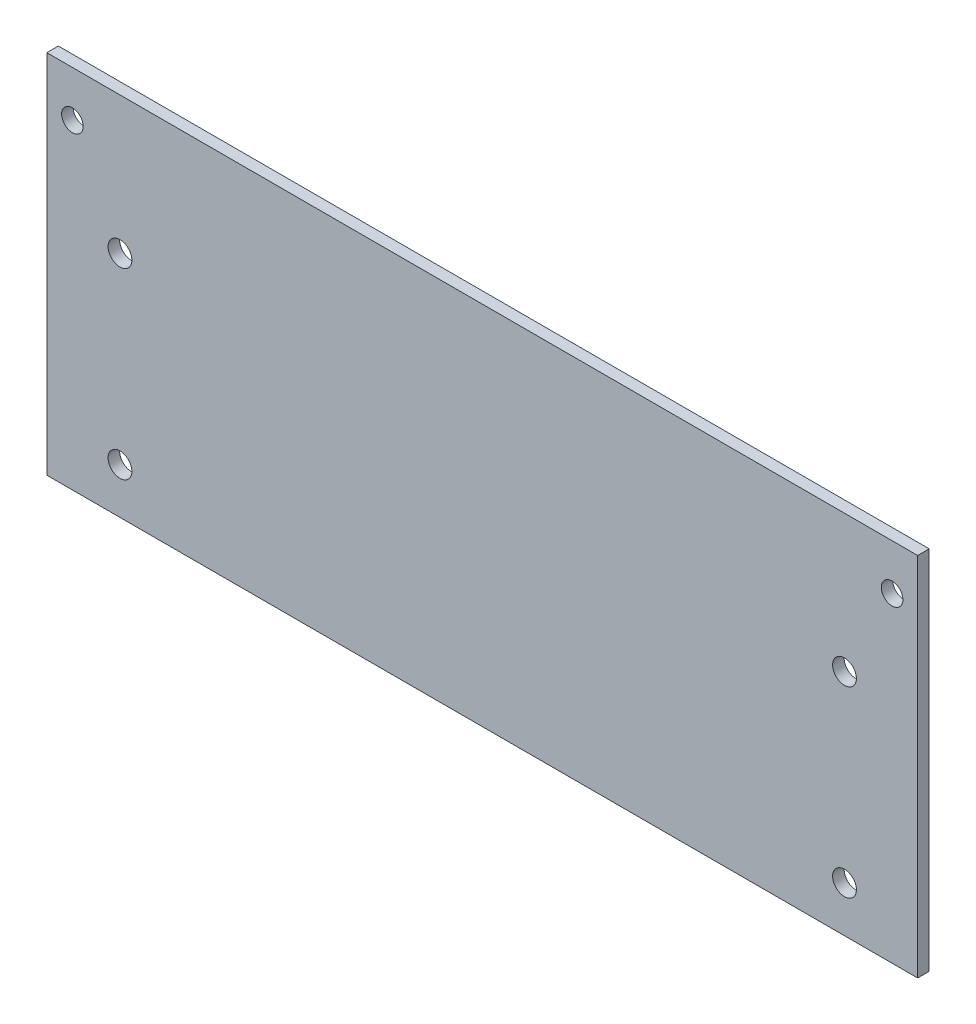
ISO-10303-21;
HEADER;
FILE_DESCRIPTION(('STEP AP214'),'2;1');
FILE_NAME('part.step','',(''),(''),'','','');
FILE_SCHEMA(('AUTOMOTIVE_DESIGN { 1 0 10303 214 1 1 1 1 }'));
ENDSEC;
DATA;
#1=APPLICATION_CONTEXT('core data for automotive mechanical design processes');
#2=APPLICATION_PROTOCOL_DEFINITION('international standard','automotive_design',2000,#1);
#3=PRODUCT_CONTEXT('',#1,'mechanical');
#4=PRODUCT('Part','Part','',(#3));
#5=PRODUCT_RELATED_PRODUCT_CATEGORY('part','',(#4));
#6=PRODUCT_DEFINITION_FORMATION('','',#4);
#7=PRODUCT_DEFINITION_CONTEXT('part definition',#1,'design');
#8=PRODUCT_DEFINITION('design','',#6,#7);
#9=PRODUCT_DEFINITION_SHAPE('','',#8);
#10=(LENGTH_UNIT() NAMED_UNIT(*) SI_UNIT(.MILLI.,.METRE.));
#11=(NAMED_UNIT(*) PLANE_ANGLE_UNIT() SI_UNIT($,.RADIAN.));
#12=(NAMED_UNIT(*) SI_UNIT($,.STERADIAN.) SOLID_ANGLE_UNIT());
#13=UNCERTAINTY_MEASURE_WITH_UNIT(LENGTH_MEASURE(1.E-05),#10,'distance_accuracy_value','');
#14=(GEOMETRIC_REPRESENTATION_CONTEXT(3) GLOBAL_UNCERTAINTY_ASSIGNED_CONTEXT((#13)) GLOBAL_UNIT_ASSIGNED_CONTEXT((#10,
#11,#12)) REPRESENTATION_CONTEXT('',''));
#15=CARTESIAN_POINT('',(0.,0.,0.));
#16=DIRECTION('',(0.,0.,1.));
#17=DIRECTION('',(1.,0.,0.));
#18=AXIS2_PLACEMENT_3D('',#15,#16,#17);
#19=CARTESIAN_POINT('',(0.,0.,1.6));
#20=DIRECTION('',(0.,0.,1.));
#21=DIRECTION('',(1.,0.,0.));
#22=AXIS2_PLACEMENT_3D('',#19,#20,#21);
#23=PLANE('',#22);
#24=CARTESIAN_POINT('',(56.896,25.4,1.6));
#25=DIRECTION('',(0.,0.,1.));
#26=DIRECTION('',(1.,0.,0.));
#27=AXIS2_PLACEMENT_3D('',#24,#25,#26);
#28=CIRCLE('',#27,1.4986);
#29=CARTESIAN_POINT('',(58.3946,25.4,1.6));
#30=VERTEX_POINT('',#29);
#31=EDGE_CURVE('E141',#30,#30,#28,.T.);
#32=ORIENTED_EDGE('',*,*,#31,.F.);
#33=EDGE_LOOP('',(#32));
#34=FACE_BOUND('',#33,.T.);
#35=CARTESIAN_POINT('',(50.292,12.7,1.6));
#36=DIRECTION('',(0.,0.,1.));
#37=DIRECTION('',(1.,0.,0.));
#38=AXIS2_PLACEMENT_3D('',#35,#36,#37);
#39=CIRCLE('',#38,1.651);
#40=CARTESIAN_POINT('',(51.943,12.7,1.6));
#41=VERTEX_POINT('',#40);
#42=EDGE_CURVE('E149',#41,#41,#39,.T.);
#43=ORIENTED_EDGE('',*,*,#42,.F.);
#44=EDGE_LOOP('',(#43));
#45=FACE_BOUND('',#44,.T.);
#46=CARTESIAN_POINT('',(-50.292,12.7,1.6));
#47=DIRECTION('',(0.,0.,1.));
#48=DIRECTION('',(1.,0.,0.));
#49=AXIS2_PLACEMENT_3D('',#46,#47,#48);
#50=CIRCLE('',#49,1.651);
#51=CARTESIAN_POINT('',(-48.641,12.7,1.6));
#52=VERTEX_POINT('',#51);
#53=EDGE_CURVE('E99',#52,#52,#50,.T.);
#54=ORIENTED_EDGE('',*,*,#53,.F.);
#55=EDGE_LOOP('',(#54));
#56=FACE_BOUND('',#55,.T.);
#57=DIRECTION('',(0.,1.,0.));
#58=VECTOR('',#57,1.);
#59=CARTESIAN_POINT('',(60.452,-19.05,1.6));
#60=LINE('',#59,#58);
#61=CARTESIAN_POINT('',(60.452,-19.05,1.6));
#62=VERTEX_POINT('',#61);
#63=CARTESIAN_POINT('',(60.452,31.75,1.6));
#64=VERTEX_POINT('',#63);
#65=EDGE_CURVE('E78',#62,#64,#60,.T.);
#66=ORIENTED_EDGE('',*,*,#65,.T.);
#67=DIRECTION('',(-1.,0.,0.));
#68=VECTOR('',#67,1.);
#69=CARTESIAN_POINT('',(60.452,31.75,1.6));
#70=LINE('',#69,#68);
#71=CARTESIAN_POINT('',(-60.452,31.75,1.6));
#72=VERTEX_POINT('',#71);
#73=EDGE_CURVE('E81',#64,#72,#70,.T.);
#74=ORIENTED_EDGE('',*,*,#73,.T.);
#75=DIRECTION('',(0.,-1.,0.));
#76=VECTOR('',#75,1.);
#77=CARTESIAN_POINT('',(-60.452,31.75,1.6));
#78=LINE('',#77,#76);
#79=CARTESIAN_POINT('',(-60.452,-19.05,1.6));
#80=VERTEX_POINT('',#79);
#81=EDGE_CURVE('E85',#72,#80,#78,.T.);
#82=ORIENTED_EDGE('',*,*,#81,.T.);
#83=DIRECTION('',(1.,0.,0.));
#84=VECTOR('',#83,1.);
#85=CARTESIAN_POINT('',(-60.452,-19.05,1.6));
#86=LINE('',#85,#84);
#87=EDGE_CURVE('E50',#80,#62,#86,.T.);
#88=ORIENTED_EDGE('',*,*,#87,.T.);
#89=EDGE_LOOP('',(#66,#74,#82,#88));
#90=FACE_BOUND('',#89,.T.);
#91=CARTESIAN_POINT('',(-50.292,-12.7,1.6));
#92=DIRECTION('',(0.,0.,1.));
#93=DIRECTION('',(1.,0.,0.));
#94=AXIS2_PLACEMENT_3D('',#91,#92,#93);
#95=CIRCLE('',#94,1.651);
#96=CARTESIAN_POINT('',(-48.641,-12.7,1.6));
#97=VERTEX_POINT('',#96);
#98=EDGE_CURVE('E153',#97,#97,#95,.T.);
#99=ORIENTED_EDGE('',*,*,#98,.F.);
#100=EDGE_LOOP('',(#99));
#101=FACE_BOUND('',#100,.T.);
#102=CARTESIAN_POINT('',(50.292,-12.7,1.6));
#103=DIRECTION('',(0.,0.,1.));
#104=DIRECTION('',(1.,0.,0.));
#105=AXIS2_PLACEMENT_3D('',#102,#103,#104);
#106=CIRCLE('',#105,1.651);
#107=CARTESIAN_POINT('',(51.943,-12.7,1.6));
#108=VERTEX_POINT('',#107);
#109=EDGE_CURVE('E145',#108,#108,#106,.T.);
#110=ORIENTED_EDGE('',*,*,#109,.F.);
#111=EDGE_LOOP('',(#110));
#112=FACE_BOUND('',#111,.T.);
#113=CARTESIAN_POINT('',(-56.896,25.4,1.6));
#114=DIRECTION('',(0.,0.,1.));
#115=DIRECTION('',(1.,0.,0.));
#116=AXIS2_PLACEMENT_3D('',#113,#114,#115);
#117=CIRCLE('',#116,1.4986);
#118=CARTESIAN_POINT('',(-55.3974,25.4,1.6));
#119=VERTEX_POINT('',#118);
#120=EDGE_CURVE('E136',#119,#119,#117,.T.);
#121=ORIENTED_EDGE('',*,*,#120,.F.);
#122=EDGE_LOOP('',(#121));
#123=FACE_BOUND('',#122,.T.);
#124=ADVANCED_FACE('F33',(#34,#45,#56,#90,#101,#112,#123),#23,.T.);
#125=CARTESIAN_POINT('',(0.,0.,0.));
#126=DIRECTION('',(0.,0.,1.));
#127=DIRECTION('',(1.,0.,0.));
#128=AXIS2_PLACEMENT_3D('',#125,#126,#127);
#129=PLANE('',#128);
#130=DIRECTION('',(0.,1.,0.));
#131=VECTOR('',#130,1.);
#132=CARTESIAN_POINT('',(60.452,19.05,0.));
#133=LINE('',#132,#131);
#134=CARTESIAN_POINT('',(60.452,-19.05,0.));
#135=VERTEX_POINT('',#134);
#136=CARTESIAN_POINT('',(60.452,31.75,0.));
#137=VERTEX_POINT('',#136);
#138=EDGE_CURVE('E73',#135,#137,#133,.T.);
#139=ORIENTED_EDGE('',*,*,#138,.F.);
#140=DIRECTION('',(1.,0.,0.));
#141=VECTOR('',#140,1.);
#142=CARTESIAN_POINT('',(-60.452,-19.05,0.));
#143=LINE('',#142,#141);
#144=CARTESIAN_POINT('',(-60.452,-19.05,0.));
#145=VERTEX_POINT('',#144);
#146=EDGE_CURVE('E102',#145,#135,#143,.T.);
#147=ORIENTED_EDGE('',*,*,#146,.F.);
#148=DIRECTION('',(0.,-1.,0.));
#149=VECTOR('',#148,1.);
#150=CARTESIAN_POINT('',(-60.452,-19.05,0.));
#151=LINE('',#150,#149);
#152=CARTESIAN_POINT('',(-60.452,31.75,0.));
#153=VERTEX_POINT('',#152);
#154=EDGE_CURVE('E66',#153,#145,#151,.T.);
#155=ORIENTED_EDGE('',*,*,#154,.F.);
#156=DIRECTION('',(-1.,0.,0.));
#157=VECTOR('',#156,1.);
#158=CARTESIAN_POINT('',(60.452,31.75,0.));
#159=LINE('',#158,#157);
#160=EDGE_CURVE('E90',#137,#153,#159,.T.);
#161=ORIENTED_EDGE('',*,*,#160,.F.);
#162=EDGE_LOOP('',(#139,#147,#155,#161));
#163=FACE_BOUND('',#162,.T.);
#164=CARTESIAN_POINT('',(-50.292,12.7,0.));
#165=DIRECTION('',(0.,0.,1.));
#166=DIRECTION('',(1.,0.,0.));
#167=AXIS2_PLACEMENT_3D('',#164,#165,#166);
#168=CIRCLE('',#167,1.651);
#169=CARTESIAN_POINT('',(-48.641,12.7,0.));
#170=VERTEX_POINT('',#169);
#171=EDGE_CURVE('E115',#170,#170,#168,.T.);
#172=ORIENTED_EDGE('',*,*,#171,.T.);
#173=EDGE_LOOP('',(#172));
#174=FACE_BOUND('',#173,.T.);
#175=CARTESIAN_POINT('',(-50.292,-12.7,0.));
#176=DIRECTION('',(0.,0.,1.));
#177=DIRECTION('',(1.,0.,0.));
#178=AXIS2_PLACEMENT_3D('',#175,#176,#177);
#179=CIRCLE('',#178,1.651);
#180=CARTESIAN_POINT('',(-48.641,-12.7,0.));
#181=VERTEX_POINT('',#180);
#182=EDGE_CURVE('E119',#181,#181,#179,.T.);
#183=ORIENTED_EDGE('',*,*,#182,.T.);
#184=EDGE_LOOP('',(#183));
#185=FACE_BOUND('',#184,.T.);
#186=CARTESIAN_POINT('',(50.292,12.7,0.));
#187=DIRECTION('',(0.,0.,1.));
#188=DIRECTION('',(1.,0.,0.));
#189=AXIS2_PLACEMENT_3D('',#186,#187,#188);
#190=CIRCLE('',#189,1.651);
#191=CARTESIAN_POINT('',(51.943,12.7,0.));
#192=VERTEX_POINT('',#191);
#193=EDGE_CURVE('E123',#192,#192,#190,.T.);
#194=ORIENTED_EDGE('',*,*,#193,.T.);
#195=EDGE_LOOP('',(#194));
#196=FACE_BOUND('',#195,.T.);
#197=CARTESIAN_POINT('',(50.292,-12.7,0.));
#198=DIRECTION('',(0.,0.,1.));
#199=DIRECTION('',(1.,0.,0.));
#200=AXIS2_PLACEMENT_3D('',#197,#198,#199);
#201=CIRCLE('',#200,1.651);
#202=CARTESIAN_POINT('',(51.943,-12.7,0.));
#203=VERTEX_POINT('',#202);
#204=EDGE_CURVE('E127',#203,#203,#201,.T.);
#205=ORIENTED_EDGE('',*,*,#204,.T.);
#206=EDGE_LOOP('',(#205));
#207=FACE_BOUND('',#206,.T.);
#208=CARTESIAN_POINT('',(56.896,25.4,0.));
#209=DIRECTION('',(0.,0.,1.));
#210=DIRECTION('',(1.,0.,0.));
#211=AXIS2_PLACEMENT_3D('',#208,#209,#210);
#212=CIRCLE('',#211,1.4986);
#213=CARTESIAN_POINT('',(58.3946,25.4,0.));
#214=VERTEX_POINT('',#213);
#215=EDGE_CURVE('E131',#214,#214,#212,.T.);
#216=ORIENTED_EDGE('',*,*,#215,.T.);
#217=EDGE_LOOP('',(#216));
#218=FACE_BOUND('',#217,.T.);
#219=CARTESIAN_POINT('',(-56.896,25.4,0.));
#220=DIRECTION('',(0.,0.,1.));
#221=DIRECTION('',(1.,0.,0.));
#222=AXIS2_PLACEMENT_3D('',#219,#220,#221);
#223=CIRCLE('',#222,1.4986);
#224=CARTESIAN_POINT('',(-55.3974,25.4,0.));
#225=VERTEX_POINT('',#224);
#226=EDGE_CURVE('E134',#225,#225,#223,.T.);
#227=ORIENTED_EDGE('',*,*,#226,.T.);
#228=EDGE_LOOP('',(#227));
#229=FACE_BOUND('',#228,.T.);
#230=ADVANCED_FACE('F108',(#163,#174,#185,#196,#207,#218,#229),#129,.F.);
#231=CARTESIAN_POINT('',(60.452,19.05,1.6));
#232=DIRECTION('',(-1.,0.,0.));
#233=DIRECTION('',(0.,-1.,0.));
#234=AXIS2_PLACEMENT_3D('',#231,#232,#233);
#235=PLANE('',#234);
#236=ORIENTED_EDGE('',*,*,#138,.T.);
#237=DIRECTION('',(0.,0.,-1.));
#238=VECTOR('',#237,1.);
#239=CARTESIAN_POINT('',(60.452,31.75,1.6));
#240=LINE('',#239,#238);
#241=EDGE_CURVE('E11',#64,#137,#240,.T.);
#242=ORIENTED_EDGE('',*,*,#241,.F.);
#243=ORIENTED_EDGE('',*,*,#65,.F.);
#244=DIRECTION('',(0.,0.,-1.));
#245=VECTOR('',#244,1.);
#246=CARTESIAN_POINT('',(60.452,-19.05,1.6));
#247=LINE('',#246,#245);
#248=EDGE_CURVE('E94',#62,#135,#247,.T.);
#249=ORIENTED_EDGE('',*,*,#248,.T.);
#250=EDGE_LOOP('',(#236,#242,#243,#249));
#251=FACE_BOUND('',#250,.T.);
#252=ADVANCED_FACE('F35',(#251),#235,.F.);
#253=CARTESIAN_POINT('',(60.452,31.75,1.6));
#254=DIRECTION('',(0.,-1.,0.));
#255=DIRECTION('',(1.,0.,0.));
#256=AXIS2_PLACEMENT_3D('',#253,#254,#255);
#257=PLANE('',#256);
#258=ORIENTED_EDGE('',*,*,#160,.T.);
#259=DIRECTION('',(0.,0.,-1.));
#260=VECTOR('',#259,1.);
#261=CARTESIAN_POINT('',(-60.452,31.75,1.6));
#262=LINE('',#261,#260);
#263=EDGE_CURVE('E42',#72,#153,#262,.T.);
#264=ORIENTED_EDGE('',*,*,#263,.F.);
#265=ORIENTED_EDGE('',*,*,#73,.F.);
#266=ORIENTED_EDGE('',*,*,#241,.T.);
#267=EDGE_LOOP('',(#258,#264,#265,#266));
#268=FACE_BOUND('',#267,.T.);
#269=ADVANCED_FACE('F89',(#268),#257,.F.);
#270=CARTESIAN_POINT('',(-60.452,-19.05,1.6));
#271=DIRECTION('',(1.,0.,0.));
#272=DIRECTION('',(0.,0.,-1.));
#273=AXIS2_PLACEMENT_3D('',#270,#271,#272);
#274=PLANE('',#273);
#275=ORIENTED_EDGE('',*,*,#154,.T.);
#276=DIRECTION('',(0.,0.,-1.));
#277=VECTOR('',#276,1.);
#278=CARTESIAN_POINT('',(-60.452,-19.05,1.6));
#279=LINE('',#278,#277);
#280=EDGE_CURVE('E91',#80,#145,#279,.T.);
#281=ORIENTED_EDGE('',*,*,#280,.F.);
#282=ORIENTED_EDGE('',*,*,#81,.F.);
#283=ORIENTED_EDGE('',*,*,#263,.T.);
#284=EDGE_LOOP('',(#275,#281,#282,#283));
#285=FACE_BOUND('',#284,.T.);
#286=ADVANCED_FACE('F92',(#285),#274,.F.);
#287=CARTESIAN_POINT('',(-60.452,-19.05,1.6));
#288=DIRECTION('',(0.,1.,0.));
#289=DIRECTION('',(0.,0.,1.));
#290=AXIS2_PLACEMENT_3D('',#287,#288,#289);
#291=PLANE('',#290);
#292=ORIENTED_EDGE('',*,*,#146,.T.);
#293=ORIENTED_EDGE('',*,*,#248,.F.);
#294=ORIENTED_EDGE('',*,*,#87,.F.);
#295=ORIENTED_EDGE('',*,*,#280,.T.);
#296=EDGE_LOOP('',(#292,#293,#294,#295));
#297=FACE_BOUND('',#296,.T.);
#298=ADVANCED_FACE('F107',(#297),#291,.F.);
#299=CARTESIAN_POINT('',(-50.292,12.7,1.6));
#300=DIRECTION('',(0.,0.,-1.));
#301=DIRECTION('',(-1.,0.,0.));
#302=AXIS2_PLACEMENT_3D('',#299,#300,#301);
#303=CYLINDRICAL_SURFACE('',#302,1.651);
#304=ORIENTED_EDGE('',*,*,#53,.T.);
#305=EDGE_LOOP('',(#304));
#306=FACE_BOUND('',#305,.T.);
#307=ORIENTED_EDGE('',*,*,#171,.F.);
#308=EDGE_LOOP('',(#307));
#309=FACE_BOUND('',#308,.T.);
#310=ADVANCED_FACE('F161',(#306,#309),#303,.F.);
#311=CARTESIAN_POINT('',(-50.292,-12.7,1.6));
#312=DIRECTION('',(0.,0.,-1.));
#313=DIRECTION('',(-1.,0.,0.));
#314=AXIS2_PLACEMENT_3D('',#311,#312,#313);
#315=CYLINDRICAL_SURFACE('',#314,1.651);
#316=ORIENTED_EDGE('',*,*,#98,.T.);
#317=EDGE_LOOP('',(#316));
#318=FACE_BOUND('',#317,.T.);
#319=ORIENTED_EDGE('',*,*,#182,.F.);
#320=EDGE_LOOP('',(#319));
#321=FACE_BOUND('',#320,.T.);
#322=ADVANCED_FACE('F224',(#318,#321),#315,.F.);
#323=CARTESIAN_POINT('',(50.292,12.7,1.6));
#324=DIRECTION('',(0.,0.,-1.));
#325=DIRECTION('',(-1.,0.,0.));
#326=AXIS2_PLACEMENT_3D('',#323,#324,#325);
#327=CYLINDRICAL_SURFACE('',#326,1.651);
#328=ORIENTED_EDGE('',*,*,#42,.T.);
#329=EDGE_LOOP('',(#328));
#330=FACE_BOUND('',#329,.T.);
#331=ORIENTED_EDGE('',*,*,#193,.F.);
#332=EDGE_LOOP('',(#331));
#333=FACE_BOUND('',#332,.T.);
#334=ADVANCED_FACE('F231',(#330,#333),#327,.F.);
#335=CARTESIAN_POINT('',(50.292,-12.7,1.6));
#336=DIRECTION('',(0.,0.,-1.));
#337=DIRECTION('',(-1.,0.,0.));
#338=AXIS2_PLACEMENT_3D('',#335,#336,#337);
#339=CYLINDRICAL_SURFACE('',#338,1.651);
#340=ORIENTED_EDGE('',*,*,#109,.T.);
#341=EDGE_LOOP('',(#340));
#342=FACE_BOUND('',#341,.T.);
#343=ORIENTED_EDGE('',*,*,#204,.F.);
#344=EDGE_LOOP('',(#343));
#345=FACE_BOUND('',#344,.T.);
#346=ADVANCED_FACE('F239',(#342,#345),#339,.F.);
#347=CARTESIAN_POINT('',(56.896,25.4,1.6));
#348=DIRECTION('',(0.,0.,-1.));
#349=DIRECTION('',(-1.,0.,0.));
#350=AXIS2_PLACEMENT_3D('',#347,#348,#349);
#351=CYLINDRICAL_SURFACE('',#350,1.4986);
#352=ORIENTED_EDGE('',*,*,#31,.T.);
#353=EDGE_LOOP('',(#352));
#354=FACE_BOUND('',#353,.T.);
#355=ORIENTED_EDGE('',*,*,#215,.F.);
#356=EDGE_LOOP('',(#355));
#357=FACE_BOUND('',#356,.T.);
#358=ADVANCED_FACE('F248',(#354,#357),#351,.F.);
#359=CARTESIAN_POINT('',(-56.896,25.4,1.6));
#360=DIRECTION('',(0.,0.,-1.));
#361=DIRECTION('',(-1.,0.,0.));
#362=AXIS2_PLACEMENT_3D('',#359,#360,#361);
#363=CYLINDRICAL_SURFACE('',#362,1.4986);
#364=ORIENTED_EDGE('',*,*,#120,.T.);
#365=EDGE_LOOP('',(#364));
#366=FACE_BOUND('',#365,.T.);
#367=ORIENTED_EDGE('',*,*,#226,.F.);
#368=EDGE_LOOP('',(#367));
#369=FACE_BOUND('',#368,.T.);
#370=ADVANCED_FACE('F257',(#366,#369),#363,.F.);
#371=CLOSED_SHELL('',(#124,#230,#252,#269,#286,#298,#310,#322,#334,#346,#358,#370));
#372=MANIFOLD_SOLID_BREP('B2',#371);
#373=ADVANCED_BREP_SHAPE_REPRESENTATION('',(#18,#372),#14);
#374=SHAPE_DEFINITION_REPRESENTATION(#9,#373);
ENDSEC;
END-ISO-10303-21;
